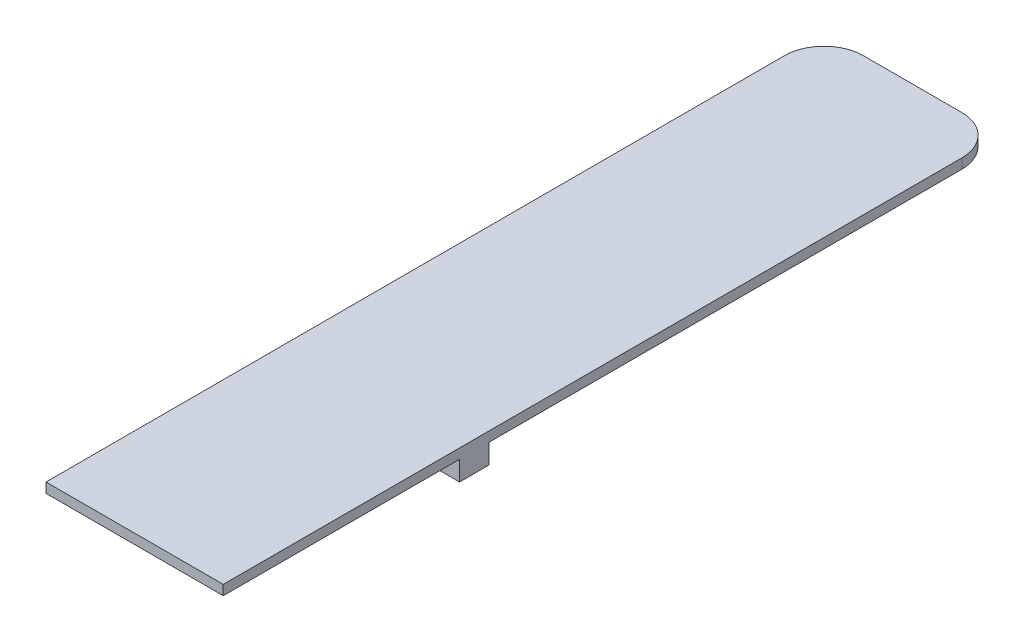
ISO-10303-21;
HEADER;
FILE_DESCRIPTION(('STEP AP214'),'2;1');
FILE_NAME('part.step','',(''),(''),'','','');
FILE_SCHEMA(('AUTOMOTIVE_DESIGN { 1 0 10303 214 1 1 1 1 }'));
ENDSEC;
DATA;
#1=APPLICATION_CONTEXT('core data for automotive mechanical design processes');
#2=APPLICATION_PROTOCOL_DEFINITION('international standard','automotive_design',2000,#1);
#3=PRODUCT_CONTEXT('',#1,'mechanical');
#4=PRODUCT('Part','Part','',(#3));
#5=PRODUCT_RELATED_PRODUCT_CATEGORY('part','',(#4));
#6=PRODUCT_DEFINITION_FORMATION('','',#4);
#7=PRODUCT_DEFINITION_CONTEXT('part definition',#1,'design');
#8=PRODUCT_DEFINITION('design','',#6,#7);
#9=PRODUCT_DEFINITION_SHAPE('','',#8);
#10=(LENGTH_UNIT() NAMED_UNIT(*) SI_UNIT(.MILLI.,.METRE.));
#11=(NAMED_UNIT(*) PLANE_ANGLE_UNIT() SI_UNIT($,.RADIAN.));
#12=(NAMED_UNIT(*) SI_UNIT($,.STERADIAN.) SOLID_ANGLE_UNIT());
#13=UNCERTAINTY_MEASURE_WITH_UNIT(LENGTH_MEASURE(1.E-05),#10,'distance_accuracy_value','');
#14=(GEOMETRIC_REPRESENTATION_CONTEXT(3) GLOBAL_UNCERTAINTY_ASSIGNED_CONTEXT((#13)) GLOBAL_UNIT_ASSIGNED_CONTEXT((#10,
#11,#12)) REPRESENTATION_CONTEXT('',''));
#15=CARTESIAN_POINT('',(0.,0.,0.));
#16=DIRECTION('',(0.,0.,1.));
#17=DIRECTION('',(1.,0.,0.));
#18=AXIS2_PLACEMENT_3D('',#15,#16,#17);
#19=CARTESIAN_POINT('',(0.,0.,0.));
#20=DIRECTION('',(0.,1.,0.));
#21=DIRECTION('',(0.,0.,1.));
#22=AXIS2_PLACEMENT_3D('',#19,#20,#21);
#23=PLANE('',#22);
#24=DIRECTION('',(0.,0.,1.));
#25=VECTOR('',#24,1.);
#26=CARTESIAN_POINT('',(0.,0.,0.));
#27=LINE('',#26,#25);
#28=CARTESIAN_POINT('',(0.,0.,4.));
#29=VERTEX_POINT('',#28);
#30=CARTESIAN_POINT('',(0.,0.,52.));
#31=VERTEX_POINT('',#30);
#32=EDGE_CURVE('E221',#29,#31,#27,.T.);
#33=ORIENTED_EDGE('',*,*,#32,.F.);
#34=CARTESIAN_POINT('',(4.,0.,4.));
#35=DIRECTION('',(0.,1.,0.));
#36=DIRECTION('',(0.,0.,1.));
#37=AXIS2_PLACEMENT_3D('',#34,#35,#36);
#38=CIRCLE('',#37,4.);
#39=CARTESIAN_POINT('',(4.,0.,0.));
#40=VERTEX_POINT('',#39);
#41=EDGE_CURVE('E238',#29,#40,#38,.F.);
#42=ORIENTED_EDGE('',*,*,#41,.T.);
#43=DIRECTION('',(-1.,0.,0.));
#44=VECTOR('',#43,1.);
#45=CARTESIAN_POINT('',(18.,0.,0.));
#46=LINE('',#45,#44);
#47=CARTESIAN_POINT('',(14.,0.,0.));
#48=VERTEX_POINT('',#47);
#49=EDGE_CURVE('E227',#48,#40,#46,.T.);
#50=ORIENTED_EDGE('',*,*,#49,.F.);
#51=CARTESIAN_POINT('',(14.,0.,4.));
#52=DIRECTION('',(0.,1.,0.));
#53=DIRECTION('',(0.,0.,1.));
#54=AXIS2_PLACEMENT_3D('',#51,#52,#53);
#55=CIRCLE('',#54,4.);
#56=CARTESIAN_POINT('',(18.,0.,4.));
#57=VERTEX_POINT('',#56);
#58=EDGE_CURVE('E236',#48,#57,#55,.F.);
#59=ORIENTED_EDGE('',*,*,#58,.T.);
#60=DIRECTION('',(0.,0.,-1.));
#61=VECTOR('',#60,1.);
#62=CARTESIAN_POINT('',(18.,0.,0.));
#63=LINE('',#62,#61);
#64=CARTESIAN_POINT('',(18.,0.,52.));
#65=VERTEX_POINT('',#64);
#66=EDGE_CURVE('E217',#65,#57,#63,.T.);
#67=ORIENTED_EDGE('',*,*,#66,.F.);
#68=DIRECTION('',(1.,0.,0.));
#69=VECTOR('',#68,1.);
#70=CARTESIAN_POINT('',(0.,0.,52.));
#71=LINE('',#70,#69);
#72=EDGE_CURVE('E197',#31,#65,#71,.T.);
#73=ORIENTED_EDGE('',*,*,#72,.F.);
#74=EDGE_LOOP('',(#33,#42,#50,#59,#67,#73));
#75=FACE_BOUND('',#74,.T.);
#76=DIRECTION('',(-1.,0.,0.));
#77=VECTOR('',#76,1.);
#78=CARTESIAN_POINT('',(14.5926655012759,0.,4.3841681234051));
#79=LINE('',#78,#77);
#80=CARTESIAN_POINT('',(12.5,0.,4.3841681234051));
#81=VERTEX_POINT('',#80);
#82=CARTESIAN_POINT('',(5.5,0.,4.3841681234051));
#83=VERTEX_POINT('',#82);
#84=EDGE_CURVE('E154',#81,#83,#79,.T.);
#85=ORIENTED_EDGE('',*,*,#84,.T.);
#86=DIRECTION('',(0.,0.,-1.));
#87=VECTOR('',#86,1.);
#88=CARTESIAN_POINT('',(5.5,0.,5.));
#89=LINE('',#88,#87);
#90=CARTESIAN_POINT('',(5.5,0.,7.));
#91=VERTEX_POINT('',#90);
#92=EDGE_CURVE('E138',#91,#83,#89,.T.);
#93=ORIENTED_EDGE('',*,*,#92,.F.);
#94=DIRECTION('',(-1.,0.,0.));
#95=VECTOR('',#94,1.);
#96=CARTESIAN_POINT('',(5.5,0.,7.));
#97=LINE('',#96,#95);
#98=CARTESIAN_POINT('',(12.5,0.,7.));
#99=VERTEX_POINT('',#98);
#100=EDGE_CURVE('E149',#99,#91,#97,.T.);
#101=ORIENTED_EDGE('',*,*,#100,.F.);
#102=DIRECTION('',(0.,0.,1.));
#103=VECTOR('',#102,1.);
#104=CARTESIAN_POINT('',(12.5,0.,5.));
#105=LINE('',#104,#103);
#106=EDGE_CURVE('E159',#81,#99,#105,.T.);
#107=ORIENTED_EDGE('',*,*,#106,.F.);
#108=EDGE_LOOP('',(#85,#93,#101,#107));
#109=FACE_BOUND('',#108,.T.);
#110=ADVANCED_FACE('F35',(#75,#109),#23,.F.);
#111=CARTESIAN_POINT('',(0.,1.,55.));
#112=DIRECTION('',(0.,0.,-1.));
#113=DIRECTION('',(-1.,0.,0.));
#114=AXIS2_PLACEMENT_3D('',#111,#112,#113);
#115=PLANE('',#114);
#116=DIRECTION('',(1.,0.,0.));
#117=VECTOR('',#116,1.);
#118=CARTESIAN_POINT('',(0.,0.,55.));
#119=LINE('',#118,#117);
#120=CARTESIAN_POINT('',(0.,0.,55.));
#121=VERTEX_POINT('',#120);
#122=CARTESIAN_POINT('',(18.,0.,55.));
#123=VERTEX_POINT('',#122);
#124=EDGE_CURVE('E176',#121,#123,#119,.T.);
#125=ORIENTED_EDGE('',*,*,#124,.F.);
#126=DIRECTION('',(0.,-1.,0.));
#127=VECTOR('',#126,1.);
#128=CARTESIAN_POINT('',(0.,1.,55.));
#129=LINE('',#128,#127);
#130=CARTESIAN_POINT('',(0.,-2.,55.));
#131=VERTEX_POINT('',#130);
#132=EDGE_CURVE('E231',#121,#131,#129,.T.);
#133=ORIENTED_EDGE('',*,*,#132,.T.);
#134=DIRECTION('',(-1.,0.,0.));
#135=VECTOR('',#134,1.);
#136=CARTESIAN_POINT('',(0.,-2.,55.));
#137=LINE('',#136,#135);
#138=CARTESIAN_POINT('',(18.,-2.,55.));
#139=VERTEX_POINT('',#138);
#140=EDGE_CURVE('E206',#139,#131,#137,.T.);
#141=ORIENTED_EDGE('',*,*,#140,.F.);
#142=DIRECTION('',(0.,-1.,0.));
#143=VECTOR('',#142,1.);
#144=CARTESIAN_POINT('',(18.,1.,55.));
#145=LINE('',#144,#143);
#146=EDGE_CURVE('E225',#123,#139,#145,.T.);
#147=ORIENTED_EDGE('',*,*,#146,.F.);
#148=EDGE_LOOP('',(#125,#133,#141,#147));
#149=FACE_BOUND('',#148,.T.);
#150=ADVANCED_FACE('F277',(#149),#115,.F.);
#151=CARTESIAN_POINT('',(18.,1.,0.));
#152=DIRECTION('',(-1.,0.,0.));
#153=DIRECTION('',(0.,0.,1.));
#154=AXIS2_PLACEMENT_3D('',#151,#152,#153);
#155=PLANE('',#154);
#156=ORIENTED_EDGE('',*,*,#66,.T.);
#157=DIRECTION('',(0.,-1.,0.));
#158=VECTOR('',#157,1.);
#159=CARTESIAN_POINT('',(18.,1.,4.));
#160=LINE('',#159,#158);
#161=CARTESIAN_POINT('',(18.,1.,4.));
#162=VERTEX_POINT('',#161);
#163=EDGE_CURVE('E11',#57,#162,#160,.F.);
#164=ORIENTED_EDGE('',*,*,#163,.T.);
#165=DIRECTION('',(0.,0.,-1.));
#166=VECTOR('',#165,1.);
#167=CARTESIAN_POINT('',(18.,1.,0.));
#168=LINE('',#167,#166);
#169=CARTESIAN_POINT('',(18.,1.,79.));
#170=VERTEX_POINT('',#169);
#171=EDGE_CURVE('E218',#170,#162,#168,.T.);
#172=ORIENTED_EDGE('',*,*,#171,.F.);
#173=DIRECTION('',(0.,1.,0.));
#174=VECTOR('',#173,1.);
#175=CARTESIAN_POINT('',(18.,0.,79.));
#176=LINE('',#175,#174);
#177=CARTESIAN_POINT('',(18.,0.,79.));
#178=VERTEX_POINT('',#177);
#179=EDGE_CURVE('E179',#178,#170,#176,.T.);
#180=ORIENTED_EDGE('',*,*,#179,.F.);
#181=DIRECTION('',(0.,0.,-1.));
#182=VECTOR('',#181,1.);
#183=CARTESIAN_POINT('',(18.,0.,79.));
#184=LINE('',#183,#182);
#185=EDGE_CURVE('E189',#178,#123,#184,.T.);
#186=ORIENTED_EDGE('',*,*,#185,.T.);
#187=ORIENTED_EDGE('',*,*,#146,.T.);
#188=DIRECTION('',(0.,0.,1.));
#189=VECTOR('',#188,1.);
#190=CARTESIAN_POINT('',(18.,-2.,55.));
#191=LINE('',#190,#189);
#192=CARTESIAN_POINT('',(18.,-2.,52.));
#193=VERTEX_POINT('',#192);
#194=EDGE_CURVE('E203',#193,#139,#191,.T.);
#195=ORIENTED_EDGE('',*,*,#194,.F.);
#196=DIRECTION('',(0.,1.,0.));
#197=VECTOR('',#196,1.);
#198=CARTESIAN_POINT('',(18.,-2.,52.));
#199=LINE('',#198,#197);
#200=EDGE_CURVE('E209',#193,#65,#199,.T.);
#201=ORIENTED_EDGE('',*,*,#200,.T.);
#202=EDGE_LOOP('',(#156,#164,#172,#180,#186,#187,#195,#201));
#203=FACE_BOUND('',#202,.T.);
#204=ADVANCED_FACE('F265',(#203),#155,.F.);
#205=CARTESIAN_POINT('',(18.,1.,0.));
#206=DIRECTION('',(0.,0.,1.));
#207=DIRECTION('',(1.,0.,0.));
#208=AXIS2_PLACEMENT_3D('',#205,#206,#207);
#209=PLANE('',#208);
#210=ORIENTED_EDGE('',*,*,#49,.T.);
#211=DIRECTION('',(0.,-1.,0.));
#212=VECTOR('',#211,1.);
#213=CARTESIAN_POINT('',(4.,1.,0.));
#214=LINE('',#213,#212);
#215=CARTESIAN_POINT('',(4.,1.,0.));
#216=VERTEX_POINT('',#215);
#217=EDGE_CURVE('E56',#40,#216,#214,.F.);
#218=ORIENTED_EDGE('',*,*,#217,.T.);
#219=DIRECTION('',(-1.,0.,0.));
#220=VECTOR('',#219,1.);
#221=CARTESIAN_POINT('',(18.,1.,0.));
#222=LINE('',#221,#220);
#223=CARTESIAN_POINT('',(14.,1.,0.));
#224=VERTEX_POINT('',#223);
#225=EDGE_CURVE('E220',#224,#216,#222,.T.);
#226=ORIENTED_EDGE('',*,*,#225,.F.);
#227=DIRECTION('',(0.,-1.,0.));
#228=VECTOR('',#227,1.);
#229=CARTESIAN_POINT('',(14.,1.,0.));
#230=LINE('',#229,#228);
#231=EDGE_CURVE('E240',#224,#48,#230,.T.);
#232=ORIENTED_EDGE('',*,*,#231,.T.);
#233=EDGE_LOOP('',(#210,#218,#226,#232));
#234=FACE_BOUND('',#233,.T.);
#235=ADVANCED_FACE('F261',(#234),#209,.F.);
#236=CARTESIAN_POINT('',(0.,1.,0.));
#237=DIRECTION('',(1.,0.,0.));
#238=DIRECTION('',(0.,0.,-1.));
#239=AXIS2_PLACEMENT_3D('',#236,#237,#238);
#240=PLANE('',#239);
#241=DIRECTION('',(0.,0.,1.));
#242=VECTOR('',#241,1.);
#243=CARTESIAN_POINT('',(0.,1.,0.));
#244=LINE('',#243,#242);
#245=CARTESIAN_POINT('',(0.,1.,4.));
#246=VERTEX_POINT('',#245);
#247=CARTESIAN_POINT('',(0.,1.,79.));
#248=VERTEX_POINT('',#247);
#249=EDGE_CURVE('E223',#246,#248,#244,.T.);
#250=ORIENTED_EDGE('',*,*,#249,.F.);
#251=DIRECTION('',(0.,-1.,0.));
#252=VECTOR('',#251,1.);
#253=CARTESIAN_POINT('',(0.,1.,4.));
#254=LINE('',#253,#252);
#255=EDGE_CURVE('E233',#246,#29,#254,.T.);
#256=ORIENTED_EDGE('',*,*,#255,.T.);
#257=ORIENTED_EDGE('',*,*,#32,.T.);
#258=DIRECTION('',(0.,1.,0.));
#259=VECTOR('',#258,1.);
#260=CARTESIAN_POINT('',(0.,-2.,52.));
#261=LINE('',#260,#259);
#262=CARTESIAN_POINT('',(0.,-2.,52.));
#263=VERTEX_POINT('',#262);
#264=EDGE_CURVE('E214',#263,#31,#261,.T.);
#265=ORIENTED_EDGE('',*,*,#264,.F.);
#266=DIRECTION('',(0.,0.,-1.));
#267=VECTOR('',#266,1.);
#268=CARTESIAN_POINT('',(0.,-2.,55.));
#269=LINE('',#268,#267);
#270=EDGE_CURVE('E198',#131,#263,#269,.T.);
#271=ORIENTED_EDGE('',*,*,#270,.F.);
#272=ORIENTED_EDGE('',*,*,#132,.F.);
#273=DIRECTION('',(0.,0.,-1.));
#274=VECTOR('',#273,1.);
#275=CARTESIAN_POINT('',(0.,0.,79.));
#276=LINE('',#275,#274);
#277=CARTESIAN_POINT('',(0.,0.,79.));
#278=VERTEX_POINT('',#277);
#279=EDGE_CURVE('E194',#278,#121,#276,.T.);
#280=ORIENTED_EDGE('',*,*,#279,.F.);
#281=DIRECTION('',(0.,-1.,0.));
#282=VECTOR('',#281,1.);
#283=CARTESIAN_POINT('',(0.,1.,79.));
#284=LINE('',#283,#282);
#285=EDGE_CURVE('E185',#248,#278,#284,.T.);
#286=ORIENTED_EDGE('',*,*,#285,.F.);
#287=EDGE_LOOP('',(#250,#256,#257,#265,#271,#272,#280,#286));
#288=FACE_BOUND('',#287,.T.);
#289=ADVANCED_FACE('F254',(#288),#240,.F.);
#290=CARTESIAN_POINT('',(0.,1.,0.));
#291=DIRECTION('',(0.,1.,0.));
#292=DIRECTION('',(0.,0.,1.));
#293=AXIS2_PLACEMENT_3D('',#290,#291,#292);
#294=PLANE('',#293);
#295=ORIENTED_EDGE('',*,*,#225,.T.);
#296=CARTESIAN_POINT('',(4.,1.,4.));
#297=DIRECTION('',(0.,1.,0.));
#298=DIRECTION('',(0.,0.,1.));
#299=AXIS2_PLACEMENT_3D('',#296,#297,#298);
#300=CIRCLE('',#299,4.);
#301=EDGE_CURVE('E43',#216,#246,#300,.T.);
#302=ORIENTED_EDGE('',*,*,#301,.T.);
#303=ORIENTED_EDGE('',*,*,#249,.T.);
#304=DIRECTION('',(-1.,0.,0.));
#305=VECTOR('',#304,1.);
#306=CARTESIAN_POINT('',(18.,1.,79.));
#307=LINE('',#306,#305);
#308=EDGE_CURVE('E182',#170,#248,#307,.T.);
#309=ORIENTED_EDGE('',*,*,#308,.F.);
#310=ORIENTED_EDGE('',*,*,#171,.T.);
#311=CARTESIAN_POINT('',(14.,1.,4.));
#312=DIRECTION('',(0.,1.,0.));
#313=DIRECTION('',(0.,0.,1.));
#314=AXIS2_PLACEMENT_3D('',#311,#312,#313);
#315=CIRCLE('',#314,4.);
#316=EDGE_CURVE('E244',#162,#224,#315,.T.);
#317=ORIENTED_EDGE('',*,*,#316,.T.);
#318=EDGE_LOOP('',(#295,#302,#303,#309,#310,#317));
#319=FACE_BOUND('',#318,.T.);
#320=ADVANCED_FACE('F248',(#319),#294,.T.);
#321=CARTESIAN_POINT('',(0.,-2.,52.));
#322=DIRECTION('',(0.,0.,1.));
#323=DIRECTION('',(1.,0.,0.));
#324=AXIS2_PLACEMENT_3D('',#321,#322,#323);
#325=PLANE('',#324);
#326=ORIENTED_EDGE('',*,*,#72,.T.);
#327=ORIENTED_EDGE('',*,*,#200,.F.);
#328=DIRECTION('',(1.,0.,0.));
#329=VECTOR('',#328,1.);
#330=CARTESIAN_POINT('',(0.,-2.,52.));
#331=LINE('',#330,#329);
#332=EDGE_CURVE('E201',#263,#193,#331,.T.);
#333=ORIENTED_EDGE('',*,*,#332,.F.);
#334=ORIENTED_EDGE('',*,*,#264,.T.);
#335=EDGE_LOOP('',(#326,#327,#333,#334));
#336=FACE_BOUND('',#335,.T.);
#337=ADVANCED_FACE('F269',(#336),#325,.F.);
#338=CARTESIAN_POINT('',(0.,-2.,0.));
#339=DIRECTION('',(0.,-1.,0.));
#340=DIRECTION('',(0.,0.,-1.));
#341=AXIS2_PLACEMENT_3D('',#338,#339,#340);
#342=PLANE('',#341);
#343=ORIENTED_EDGE('',*,*,#270,.T.);
#344=ORIENTED_EDGE('',*,*,#332,.T.);
#345=ORIENTED_EDGE('',*,*,#194,.T.);
#346=ORIENTED_EDGE('',*,*,#140,.T.);
#347=EDGE_LOOP('',(#343,#344,#345,#346));
#348=FACE_BOUND('',#347,.T.);
#349=ADVANCED_FACE('F274',(#348),#342,.T.);
#350=CARTESIAN_POINT('',(0.,0.,79.));
#351=DIRECTION('',(0.,1.,0.));
#352=DIRECTION('',(0.,0.,1.));
#353=AXIS2_PLACEMENT_3D('',#350,#351,#352);
#354=PLANE('',#353);
#355=ORIENTED_EDGE('',*,*,#124,.T.);
#356=ORIENTED_EDGE('',*,*,#185,.F.);
#357=DIRECTION('',(1.,0.,0.));
#358=VECTOR('',#357,1.);
#359=CARTESIAN_POINT('',(0.,0.,79.));
#360=LINE('',#359,#358);
#361=EDGE_CURVE('E187',#278,#178,#360,.T.);
#362=ORIENTED_EDGE('',*,*,#361,.F.);
#363=ORIENTED_EDGE('',*,*,#279,.T.);
#364=EDGE_LOOP('',(#355,#356,#362,#363));
#365=FACE_BOUND('',#364,.T.);
#366=ADVANCED_FACE('F280',(#365),#354,.F.);
#367=CARTESIAN_POINT('',(0.,0.,79.));
#368=DIRECTION('',(0.,0.,1.));
#369=DIRECTION('',(1.,0.,0.));
#370=AXIS2_PLACEMENT_3D('',#367,#368,#369);
#371=PLANE('',#370);
#372=ORIENTED_EDGE('',*,*,#179,.T.);
#373=ORIENTED_EDGE('',*,*,#308,.T.);
#374=ORIENTED_EDGE('',*,*,#285,.T.);
#375=ORIENTED_EDGE('',*,*,#361,.T.);
#376=EDGE_LOOP('',(#372,#373,#374,#375));
#377=FACE_BOUND('',#376,.T.);
#378=ADVANCED_FACE('F284',(#377),#371,.T.);
#379=CARTESIAN_POINT('',(12.5,-2.,5.));
#380=DIRECTION('',(-1.,0.,0.));
#381=DIRECTION('',(0.,0.,1.));
#382=AXIS2_PLACEMENT_3D('',#379,#380,#381);
#383=PLANE('',#382);
#384=ORIENTED_EDGE('',*,*,#106,.T.);
#385=DIRECTION('',(0.,-0.955718913883074,0.294281086116927));
#386=VECTOR('',#385,1.);
#387=CARTESIAN_POINT('',(12.5,0.,7.));
#388=LINE('',#387,#386);
#389=CARTESIAN_POINT('',(12.5,-2.,7.6158318765949));
#390=VERTEX_POINT('',#389);
#391=EDGE_CURVE('E165',#99,#390,#388,.T.);
#392=ORIENTED_EDGE('',*,*,#391,.T.);
#393=DIRECTION('',(0.,0.,1.));
#394=VECTOR('',#393,1.);
#395=CARTESIAN_POINT('',(12.5,-2.,5.));
#396=LINE('',#395,#394);
#397=CARTESIAN_POINT('',(12.5,-2.,5.));
#398=VERTEX_POINT('',#397);
#399=EDGE_CURVE('E148',#398,#390,#396,.T.);
#400=ORIENTED_EDGE('',*,*,#399,.F.);
#401=DIRECTION('',(0.,0.955718913883074,-0.294281086116926));
#402=VECTOR('',#401,1.);
#403=CARTESIAN_POINT('',(12.5,-2.,5.));
#404=LINE('',#403,#402);
#405=EDGE_CURVE('E161',#398,#81,#404,.T.);
#406=ORIENTED_EDGE('',*,*,#405,.T.);
#407=EDGE_LOOP('',(#384,#392,#400,#406));
#408=FACE_BOUND('',#407,.T.);
#409=ADVANCED_FACE('F286',(#408),#383,.F.);
#410=CARTESIAN_POINT('',(5.5,-2.,5.));
#411=DIRECTION('',(1.,0.,0.));
#412=DIRECTION('',(0.,0.,-1.));
#413=AXIS2_PLACEMENT_3D('',#410,#411,#412);
#414=PLANE('',#413);
#415=ORIENTED_EDGE('',*,*,#92,.T.);
#416=DIRECTION('',(0.,-0.955718913883074,0.294281086116926));
#417=VECTOR('',#416,1.);
#418=CARTESIAN_POINT('',(5.5,-2.,5.));
#419=LINE('',#418,#417);
#420=CARTESIAN_POINT('',(5.5,-2.,5.));
#421=VERTEX_POINT('',#420);
#422=EDGE_CURVE('E141',#83,#421,#419,.T.);
#423=ORIENTED_EDGE('',*,*,#422,.T.);
#424=DIRECTION('',(0.,0.,-1.));
#425=VECTOR('',#424,1.);
#426=CARTESIAN_POINT('',(5.5,-2.,5.));
#427=LINE('',#426,#425);
#428=CARTESIAN_POINT('',(5.5,-2.,7.6158318765949));
#429=VERTEX_POINT('',#428);
#430=EDGE_CURVE('E173',#429,#421,#427,.T.);
#431=ORIENTED_EDGE('',*,*,#430,.F.);
#432=DIRECTION('',(0.,0.955718913883074,-0.294281086116927));
#433=VECTOR('',#432,1.);
#434=CARTESIAN_POINT('',(5.5,0.,7.));
#435=LINE('',#434,#433);
#436=EDGE_CURVE('E144',#429,#91,#435,.T.);
#437=ORIENTED_EDGE('',*,*,#436,.T.);
#438=EDGE_LOOP('',(#415,#423,#431,#437));
#439=FACE_BOUND('',#438,.T.);
#440=ADVANCED_FACE('F140',(#439),#414,.F.);
#441=CARTESIAN_POINT('',(0.,-2.,0.));
#442=DIRECTION('',(0.,1.,0.));
#443=DIRECTION('',(0.,0.,1.));
#444=AXIS2_PLACEMENT_3D('',#441,#442,#443);
#445=PLANE('',#444);
#446=ORIENTED_EDGE('',*,*,#399,.T.);
#447=DIRECTION('',(-1.,0.,0.));
#448=VECTOR('',#447,1.);
#449=CARTESIAN_POINT('',(14.5926655012759,-2.,7.6158318765949));
#450=LINE('',#449,#448);
#451=EDGE_CURVE('E168',#390,#429,#450,.T.);
#452=ORIENTED_EDGE('',*,*,#451,.T.);
#453=ORIENTED_EDGE('',*,*,#430,.T.);
#454=DIRECTION('',(1.,0.,0.));
#455=VECTOR('',#454,1.);
#456=CARTESIAN_POINT('',(5.5,-2.,5.));
#457=LINE('',#456,#455);
#458=EDGE_CURVE('E156',#421,#398,#457,.T.);
#459=ORIENTED_EDGE('',*,*,#458,.T.);
#460=EDGE_LOOP('',(#446,#452,#453,#459));
#461=FACE_BOUND('',#460,.T.);
#462=ADVANCED_FACE('F312',(#461),#445,.F.);
#463=CARTESIAN_POINT('',(4.,1.,4.));
#464=DIRECTION('',(0.,-1.,0.));
#465=DIRECTION('',(0.,0.,-1.));
#466=AXIS2_PLACEMENT_3D('',#463,#464,#465);
#467=CYLINDRICAL_SURFACE('',#466,4.);
#468=ORIENTED_EDGE('',*,*,#301,.F.);
#469=ORIENTED_EDGE('',*,*,#217,.F.);
#470=ORIENTED_EDGE('',*,*,#41,.F.);
#471=ORIENTED_EDGE('',*,*,#255,.F.);
#472=EDGE_LOOP('',(#468,#469,#470,#471));
#473=FACE_BOUND('',#472,.T.);
#474=ADVANCED_FACE('F257',(#473),#467,.T.);
#475=CARTESIAN_POINT('',(14.,1.,4.));
#476=DIRECTION('',(0.,-1.,0.));
#477=DIRECTION('',(0.,0.,-1.));
#478=AXIS2_PLACEMENT_3D('',#475,#476,#477);
#479=CYLINDRICAL_SURFACE('',#478,4.);
#480=ORIENTED_EDGE('',*,*,#316,.F.);
#481=ORIENTED_EDGE('',*,*,#163,.F.);
#482=ORIENTED_EDGE('',*,*,#58,.F.);
#483=ORIENTED_EDGE('',*,*,#231,.F.);
#484=EDGE_LOOP('',(#480,#481,#482,#483));
#485=FACE_BOUND('',#484,.T.);
#486=ADVANCED_FACE('F37',(#485),#479,.T.);
#487=CARTESIAN_POINT('',(14.5926655012759,0.,7.));
#488=DIRECTION('',(0.,0.294281086116927,0.955718913883074));
#489=DIRECTION('',(0.,-0.955718913883074,0.294281086116927));
#490=AXIS2_PLACEMENT_3D('',#487,#488,#489);
#491=PLANE('',#490);
#492=ORIENTED_EDGE('',*,*,#391,.F.);
#493=ORIENTED_EDGE('',*,*,#100,.T.);
#494=ORIENTED_EDGE('',*,*,#436,.F.);
#495=ORIENTED_EDGE('',*,*,#451,.F.);
#496=EDGE_LOOP('',(#492,#493,#494,#495));
#497=FACE_BOUND('',#496,.T.);
#498=ADVANCED_FACE('F317',(#497),#491,.T.);
#499=CARTESIAN_POINT('',(14.5926655012759,-2.,5.));
#500=DIRECTION('',(0.,-0.294281086116926,-0.955718913883074));
#501=DIRECTION('',(0.,0.955718913883074,-0.294281086116926));
#502=AXIS2_PLACEMENT_3D('',#499,#500,#501);
#503=PLANE('',#502);
#504=ORIENTED_EDGE('',*,*,#405,.F.);
#505=ORIENTED_EDGE('',*,*,#458,.F.);
#506=ORIENTED_EDGE('',*,*,#422,.F.);
#507=ORIENTED_EDGE('',*,*,#84,.F.);
#508=EDGE_LOOP('',(#504,#505,#506,#507));
#509=FACE_BOUND('',#508,.T.);
#510=ADVANCED_FACE('F153',(#509),#503,.T.);
#511=CLOSED_SHELL('',(#110,#150,#204,#235,#289,#320,#337,#349,#366,#378,#409,#440,#462,#474,
#486,#498,#510));
#512=MANIFOLD_SOLID_BREP('B2',#511);
#513=ADVANCED_BREP_SHAPE_REPRESENTATION('',(#18,#512),#14);
#514=SHAPE_DEFINITION_REPRESENTATION(#9,#513);
ENDSEC;
END-ISO-10303-21;
